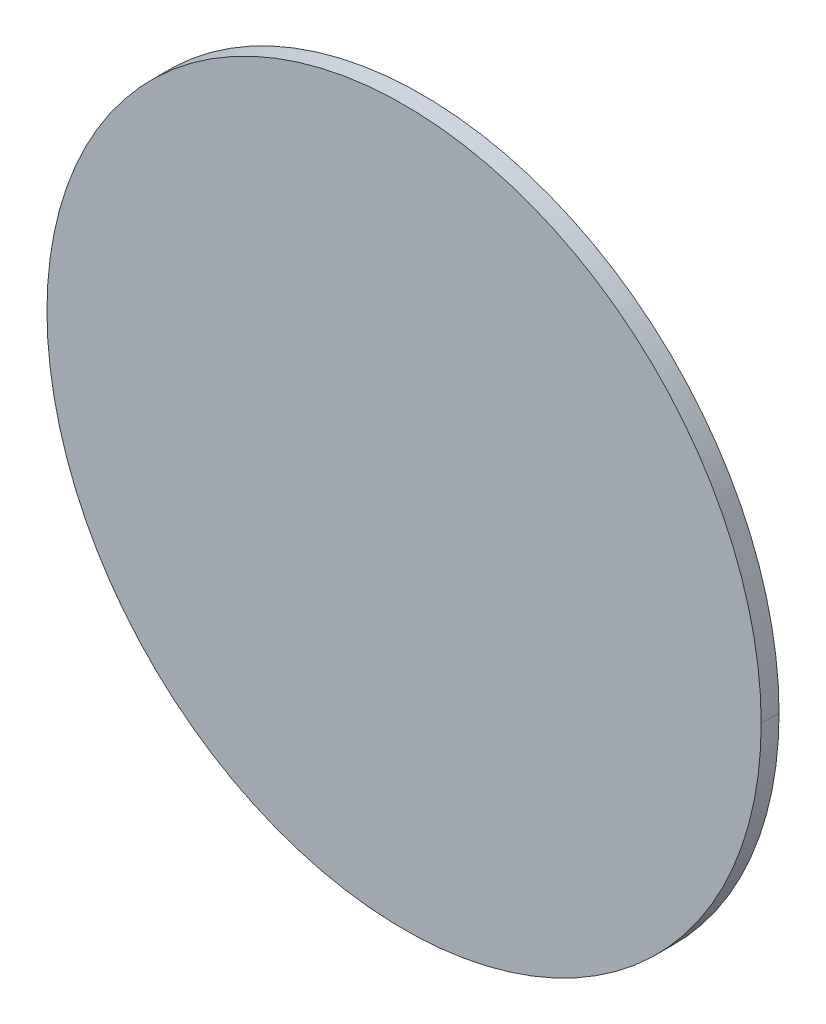
ISO-10303-21;
HEADER;
FILE_DESCRIPTION(('STEP AP214'),'2;1');
FILE_NAME('part.step','',(''),(''),'','','');
FILE_SCHEMA(('AUTOMOTIVE_DESIGN { 1 0 10303 214 1 1 1 1 }'));
ENDSEC;
DATA;
#1=APPLICATION_CONTEXT('core data for automotive mechanical design processes');
#2=APPLICATION_PROTOCOL_DEFINITION('international standard','automotive_design',2000,#1);
#3=PRODUCT_CONTEXT('',#1,'mechanical');
#4=PRODUCT('Part','Part','',(#3));
#5=PRODUCT_RELATED_PRODUCT_CATEGORY('part','',(#4));
#6=PRODUCT_DEFINITION_FORMATION('','',#4);
#7=PRODUCT_DEFINITION_CONTEXT('part definition',#1,'design');
#8=PRODUCT_DEFINITION('design','',#6,#7);
#9=PRODUCT_DEFINITION_SHAPE('','',#8);
#10=(LENGTH_UNIT() NAMED_UNIT(*) SI_UNIT(.MILLI.,.METRE.));
#11=(NAMED_UNIT(*) PLANE_ANGLE_UNIT() SI_UNIT($,.RADIAN.));
#12=(NAMED_UNIT(*) SI_UNIT($,.STERADIAN.) SOLID_ANGLE_UNIT());
#13=UNCERTAINTY_MEASURE_WITH_UNIT(LENGTH_MEASURE(1.E-05),#10,'distance_accuracy_value','');
#14=(GEOMETRIC_REPRESENTATION_CONTEXT(3) GLOBAL_UNCERTAINTY_ASSIGNED_CONTEXT((#13)) GLOBAL_UNIT_ASSIGNED_CONTEXT((#10,
#11,#12)) REPRESENTATION_CONTEXT('',''));
#15=CARTESIAN_POINT('',(0.,0.,0.));
#16=DIRECTION('',(0.,0.,1.));
#17=DIRECTION('',(1.,0.,0.));
#18=AXIS2_PLACEMENT_3D('',#15,#16,#17);
#19=CARTESIAN_POINT('',(0.1999996,0.,0.00999998));
#20=DIRECTION('',(0.,0.,-1.));
#21=DIRECTION('',(0.,-1.,0.));
#22=AXIS2_PLACEMENT_3D('',#19,#20,#21);
#23=PLANE('',#22);
#24=CARTESIAN_POINT('',(0.,0.,0.00999998));
#25=DIRECTION('',(0.,0.,-1.));
#26=DIRECTION('',(-1.,0.,0.));
#27=AXIS2_PLACEMENT_3D('',#24,#25,#26);
#28=CIRCLE('',#27,0.1999996);
#29=CARTESIAN_POINT('',(-0.1999996,0.,0.00999998));
#30=VERTEX_POINT('',#29);
#31=CARTESIAN_POINT('',(0.1999996,0.,0.00999998));
#32=VERTEX_POINT('',#31);
#33=EDGE_CURVE('E62',#30,#32,#28,.T.);
#34=ORIENTED_EDGE('',*,*,#33,.F.);
#35=CARTESIAN_POINT('',(0.,0.,0.00999998));
#36=DIRECTION('',(0.,0.,-1.));
#37=DIRECTION('',(-1.,0.,0.));
#38=AXIS2_PLACEMENT_3D('',#35,#36,#37);
#39=CIRCLE('',#38,0.1999996);
#40=EDGE_CURVE('E11',#32,#30,#39,.T.);
#41=ORIENTED_EDGE('',*,*,#40,.F.);
#42=EDGE_LOOP('',(#34,#41));
#43=FACE_BOUND('',#42,.T.);
#44=ADVANCED_FACE('F17',(#43),#23,.F.);
#45=CARTESIAN_POINT('',(0.,0.,0.));
#46=DIRECTION('',(0.,0.,-1.));
#47=DIRECTION('',(-1.,0.,0.));
#48=AXIS2_PLACEMENT_3D('',#45,#46,#47);
#49=CYLINDRICAL_SURFACE('',#48,0.1999996);
#50=DIRECTION('',(0.,0.,-1.));
#51=VECTOR('',#50,1.);
#52=CARTESIAN_POINT('',(0.1999996,0.,0.));
#53=LINE('',#52,#51);
#54=CARTESIAN_POINT('',(0.1999996,0.,0.));
#55=VERTEX_POINT('',#54);
#56=EDGE_CURVE('E58',#32,#55,#53,.T.);
#57=ORIENTED_EDGE('',*,*,#56,.F.);
#58=ORIENTED_EDGE('',*,*,#40,.T.);
#59=DIRECTION('',(0.,0.,-1.));
#60=VECTOR('',#59,1.);
#61=CARTESIAN_POINT('',(-0.1999996,0.,0.));
#62=LINE('',#61,#60);
#63=CARTESIAN_POINT('',(-0.1999996,0.,0.));
#64=VERTEX_POINT('',#63);
#65=EDGE_CURVE('E55',#30,#64,#62,.T.);
#66=ORIENTED_EDGE('',*,*,#65,.T.);
#67=CARTESIAN_POINT('',(0.,0.,0.));
#68=DIRECTION('',(0.,0.,-1.));
#69=DIRECTION('',(-1.,0.,0.));
#70=AXIS2_PLACEMENT_3D('',#67,#68,#69);
#71=CIRCLE('',#70,0.1999996);
#72=EDGE_CURVE('E26',#55,#64,#71,.T.);
#73=ORIENTED_EDGE('',*,*,#72,.F.);
#74=EDGE_LOOP('',(#57,#58,#66,#73));
#75=FACE_BOUND('',#74,.T.);
#76=ADVANCED_FACE('F54',(#75),#49,.T.);
#77=CARTESIAN_POINT('',(0.1999996,0.,0.));
#78=DIRECTION('',(0.,0.,-1.));
#79=DIRECTION('',(0.,-1.,0.));
#80=AXIS2_PLACEMENT_3D('',#77,#78,#79);
#81=PLANE('',#80);
#82=CARTESIAN_POINT('',(0.,0.,0.));
#83=DIRECTION('',(0.,0.,-1.));
#84=DIRECTION('',(-1.,0.,0.));
#85=AXIS2_PLACEMENT_3D('',#82,#83,#84);
#86=CIRCLE('',#85,0.1999996);
#87=EDGE_CURVE('E63',#64,#55,#86,.T.);
#88=ORIENTED_EDGE('',*,*,#87,.T.);
#89=ORIENTED_EDGE('',*,*,#72,.T.);
#90=EDGE_LOOP('',(#88,#89));
#91=FACE_BOUND('',#90,.T.);
#92=ADVANCED_FACE('F117',(#91),#81,.T.);
#93=CARTESIAN_POINT('',(0.,0.,0.));
#94=DIRECTION('',(0.,0.,-1.));
#95=DIRECTION('',(-1.,0.,0.));
#96=AXIS2_PLACEMENT_3D('',#93,#94,#95);
#97=CYLINDRICAL_SURFACE('',#96,0.1999996);
#98=ORIENTED_EDGE('',*,*,#33,.T.);
#99=ORIENTED_EDGE('',*,*,#56,.T.);
#100=ORIENTED_EDGE('',*,*,#87,.F.);
#101=ORIENTED_EDGE('',*,*,#65,.F.);
#102=EDGE_LOOP('',(#98,#99,#100,#101));
#103=FACE_BOUND('',#102,.T.);
#104=ADVANCED_FACE('F61',(#103),#97,.T.);
#105=CLOSED_SHELL('',(#44,#76,#92,#104));
#106=MANIFOLD_SOLID_BREP('B1',#105);
#107=ADVANCED_BREP_SHAPE_REPRESENTATION('',(#18,#106),#14);
#108=SHAPE_DEFINITION_REPRESENTATION(#9,#107);
ENDSEC;
END-ISO-10303-21;
